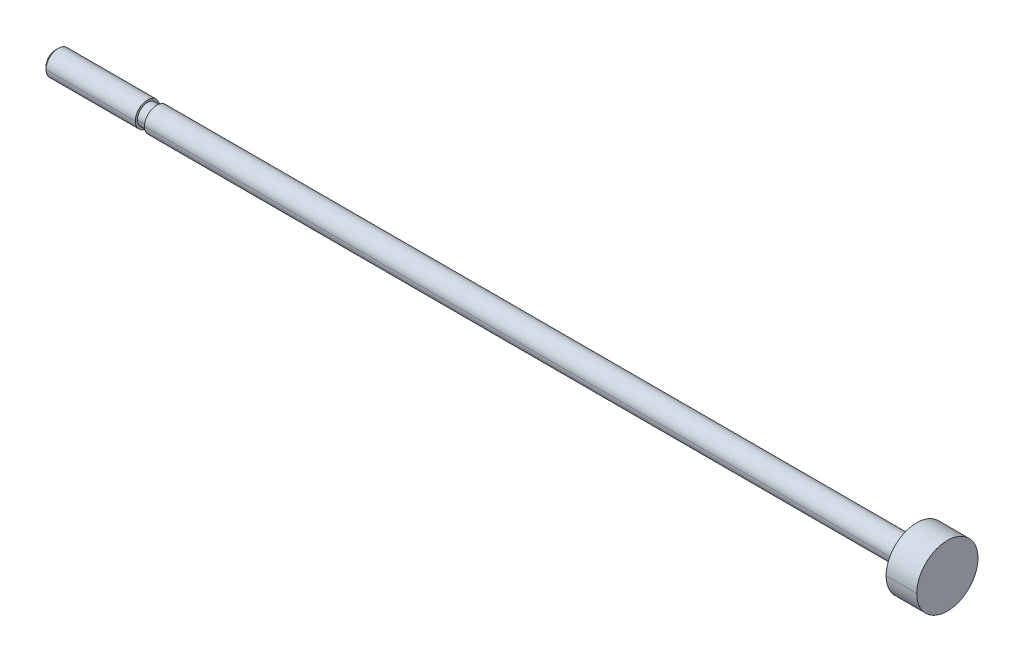
ISO-10303-21;
HEADER;
FILE_DESCRIPTION(('STEP AP214'),'2;1');
FILE_NAME('part.step','',(''),(''),'','','');
FILE_SCHEMA(('AUTOMOTIVE_DESIGN { 1 0 10303 214 1 1 1 1 }'));
ENDSEC;
DATA;
#1=APPLICATION_CONTEXT('core data for automotive mechanical design processes');
#2=APPLICATION_PROTOCOL_DEFINITION('international standard','automotive_design',2000,#1);
#3=PRODUCT_CONTEXT('',#1,'mechanical');
#4=PRODUCT('Part','Part','',(#3));
#5=PRODUCT_RELATED_PRODUCT_CATEGORY('part','',(#4));
#6=PRODUCT_DEFINITION_FORMATION('','',#4);
#7=PRODUCT_DEFINITION_CONTEXT('part definition',#1,'design');
#8=PRODUCT_DEFINITION('design','',#6,#7);
#9=PRODUCT_DEFINITION_SHAPE('','',#8);
#10=(LENGTH_UNIT() NAMED_UNIT(*) SI_UNIT(.MILLI.,.METRE.));
#11=(NAMED_UNIT(*) PLANE_ANGLE_UNIT() SI_UNIT($,.RADIAN.));
#12=(NAMED_UNIT(*) SI_UNIT($,.STERADIAN.) SOLID_ANGLE_UNIT());
#13=UNCERTAINTY_MEASURE_WITH_UNIT(LENGTH_MEASURE(1.E-05),#10,'distance_accuracy_value','');
#14=(GEOMETRIC_REPRESENTATION_CONTEXT(3) GLOBAL_UNCERTAINTY_ASSIGNED_CONTEXT((#13)) GLOBAL_UNIT_ASSIGNED_CONTEXT((#10,
#11,#12)) REPRESENTATION_CONTEXT('',''));
#15=CARTESIAN_POINT('',(0.,0.,0.));
#16=DIRECTION('',(0.,0.,1.));
#17=DIRECTION('',(1.,0.,0.));
#18=AXIS2_PLACEMENT_3D('',#15,#16,#17);
#19=CARTESIAN_POINT('',(145.5,0.,0.));
#20=DIRECTION('',(-1.,0.,0.));
#21=DIRECTION('',(0.,-1.,0.));
#22=AXIS2_PLACEMENT_3D('',#19,#20,#21);
#23=CYLINDRICAL_SURFACE('',#22,5.);
#24=CARTESIAN_POINT('',(145.5,0.,0.));
#25=DIRECTION('',(1.,0.,0.));
#26=DIRECTION('',(0.,0.,-1.));
#27=AXIS2_PLACEMENT_3D('',#24,#25,#26);
#28=CIRCLE('',#27,5.);
#29=CARTESIAN_POINT('',(145.5,0.,-5.));
#30=VERTEX_POINT('',#29);
#31=CARTESIAN_POINT('',(145.5,0.,5.));
#32=VERTEX_POINT('',#31);
#33=EDGE_CURVE('E11',#30,#32,#28,.T.);
#34=ORIENTED_EDGE('',*,*,#33,.F.);
#35=DIRECTION('',(-1.,0.,0.));
#36=VECTOR('',#35,1.);
#37=CARTESIAN_POINT('',(145.5,0.,-5.));
#38=LINE('',#37,#36);
#39=CARTESIAN_POINT('',(140.5,0.,-5.));
#40=VERTEX_POINT('',#39);
#41=EDGE_CURVE('E25',#30,#40,#38,.T.);
#42=ORIENTED_EDGE('',*,*,#41,.T.);
#43=CARTESIAN_POINT('',(140.5,0.,0.));
#44=DIRECTION('',(1.,0.,0.));
#45=DIRECTION('',(0.,0.,-1.));
#46=AXIS2_PLACEMENT_3D('',#43,#44,#45);
#47=CIRCLE('',#46,5.);
#48=CARTESIAN_POINT('',(140.5,0.,5.));
#49=VERTEX_POINT('',#48);
#50=EDGE_CURVE('E201',#40,#49,#47,.T.);
#51=ORIENTED_EDGE('',*,*,#50,.T.);
#52=DIRECTION('',(-1.,0.,0.));
#53=VECTOR('',#52,1.);
#54=CARTESIAN_POINT('',(145.5,0.,5.));
#55=LINE('',#54,#53);
#56=EDGE_CURVE('E196',#32,#49,#55,.T.);
#57=ORIENTED_EDGE('',*,*,#56,.F.);
#58=EDGE_LOOP('',(#34,#42,#51,#57));
#59=FACE_BOUND('',#58,.T.);
#60=ADVANCED_FACE('F17',(#59),#23,.T.);
#61=CARTESIAN_POINT('',(145.5,0.,0.));
#62=DIRECTION('',(-1.,0.,0.));
#63=DIRECTION('',(0.,1.,0.));
#64=AXIS2_PLACEMENT_3D('',#61,#62,#63);
#65=CYLINDRICAL_SURFACE('',#64,5.);
#66=CARTESIAN_POINT('',(140.5,0.,0.));
#67=DIRECTION('',(1.,0.,0.));
#68=DIRECTION('',(0.,0.,-1.));
#69=AXIS2_PLACEMENT_3D('',#66,#67,#68);
#70=CIRCLE('',#69,5.);
#71=EDGE_CURVE('E192',#49,#40,#70,.T.);
#72=ORIENTED_EDGE('',*,*,#71,.T.);
#73=ORIENTED_EDGE('',*,*,#41,.F.);
#74=CARTESIAN_POINT('',(145.5,0.,0.));
#75=DIRECTION('',(1.,0.,0.));
#76=DIRECTION('',(0.,0.,-1.));
#77=AXIS2_PLACEMENT_3D('',#74,#75,#76);
#78=CIRCLE('',#77,5.);
#79=EDGE_CURVE('E187',#32,#30,#78,.T.);
#80=ORIENTED_EDGE('',*,*,#79,.F.);
#81=ORIENTED_EDGE('',*,*,#56,.T.);
#82=EDGE_LOOP('',(#72,#73,#80,#81));
#83=FACE_BOUND('',#82,.T.);
#84=ADVANCED_FACE('F214',(#83),#65,.T.);
#85=CARTESIAN_POINT('',(145.5,5.,0.));
#86=DIRECTION('',(-1.,0.,0.));
#87=DIRECTION('',(0.,0.,1.));
#88=AXIS2_PLACEMENT_3D('',#85,#86,#87);
#89=PLANE('',#88);
#90=ORIENTED_EDGE('',*,*,#33,.T.);
#91=ORIENTED_EDGE('',*,*,#79,.T.);
#92=EDGE_LOOP('',(#90,#91));
#93=FACE_BOUND('',#92,.T.);
#94=ADVANCED_FACE('F219',(#93),#89,.F.);
#95=CARTESIAN_POINT('',(140.5,2.,0.));
#96=DIRECTION('',(1.,0.,0.));
#97=DIRECTION('',(0.,0.,-1.));
#98=AXIS2_PLACEMENT_3D('',#95,#96,#97);
#99=PLANE('',#98);
#100=ORIENTED_EDGE('',*,*,#50,.F.);
#101=ORIENTED_EDGE('',*,*,#71,.F.);
#102=EDGE_LOOP('',(#100,#101));
#103=FACE_BOUND('',#102,.T.);
#104=CARTESIAN_POINT('',(140.5,0.,0.));
#105=DIRECTION('',(1.,0.,0.));
#106=DIRECTION('',(0.,0.,-1.));
#107=AXIS2_PLACEMENT_3D('',#104,#105,#106);
#108=CIRCLE('',#107,2.);
#109=CARTESIAN_POINT('',(140.5,0.,-2.));
#110=VERTEX_POINT('',#109);
#111=CARTESIAN_POINT('',(140.5,0.,2.));
#112=VERTEX_POINT('',#111);
#113=EDGE_CURVE('E183',#110,#112,#108,.T.);
#114=ORIENTED_EDGE('',*,*,#113,.T.);
#115=CARTESIAN_POINT('',(140.5,0.,0.));
#116=DIRECTION('',(1.,0.,0.));
#117=DIRECTION('',(0.,0.,-1.));
#118=AXIS2_PLACEMENT_3D('',#115,#116,#117);
#119=CIRCLE('',#118,2.);
#120=EDGE_CURVE('E179',#112,#110,#119,.T.);
#121=ORIENTED_EDGE('',*,*,#120,.T.);
#122=EDGE_LOOP('',(#114,#121));
#123=FACE_BOUND('',#122,.T.);
#124=ADVANCED_FACE('F215',(#103,#123),#99,.F.);
#125=CARTESIAN_POINT('',(145.5,0.,0.));
#126=DIRECTION('',(-1.,0.,0.));
#127=DIRECTION('',(0.,1.,0.));
#128=AXIS2_PLACEMENT_3D('',#125,#126,#127);
#129=CYLINDRICAL_SURFACE('',#128,2.);
#130=CARTESIAN_POINT('',(16.5,0.,0.));
#131=DIRECTION('',(1.,0.,0.));
#132=DIRECTION('',(0.,0.,-1.));
#133=AXIS2_PLACEMENT_3D('',#130,#131,#132);
#134=CIRCLE('',#133,2.);
#135=CARTESIAN_POINT('',(16.5,0.,2.));
#136=VERTEX_POINT('',#135);
#137=CARTESIAN_POINT('',(16.5,0.,-2.));
#138=VERTEX_POINT('',#137);
#139=EDGE_CURVE('E175',#136,#138,#134,.T.);
#140=ORIENTED_EDGE('',*,*,#139,.T.);
#141=DIRECTION('',(-1.,0.,0.));
#142=VECTOR('',#141,1.);
#143=CARTESIAN_POINT('',(140.5,0.,-2.));
#144=LINE('',#143,#142);
#145=EDGE_CURVE('E170',#110,#138,#144,.T.);
#146=ORIENTED_EDGE('',*,*,#145,.F.);
#147=ORIENTED_EDGE('',*,*,#120,.F.);
#148=DIRECTION('',(-1.,0.,0.));
#149=VECTOR('',#148,1.);
#150=CARTESIAN_POINT('',(140.5,0.,2.));
#151=LINE('',#150,#149);
#152=EDGE_CURVE('E166',#112,#136,#151,.T.);
#153=ORIENTED_EDGE('',*,*,#152,.T.);
#154=EDGE_LOOP('',(#140,#146,#147,#153));
#155=FACE_BOUND('',#154,.T.);
#156=ADVANCED_FACE('F218',(#155),#129,.T.);
#157=CARTESIAN_POINT('',(145.5,0.,0.));
#158=DIRECTION('',(-1.,0.,0.));
#159=DIRECTION('',(0.,-1.,0.));
#160=AXIS2_PLACEMENT_3D('',#157,#158,#159);
#161=CYLINDRICAL_SURFACE('',#160,2.);
#162=ORIENTED_EDGE('',*,*,#113,.F.);
#163=ORIENTED_EDGE('',*,*,#145,.T.);
#164=CARTESIAN_POINT('',(16.5,0.,0.));
#165=DIRECTION('',(1.,0.,0.));
#166=DIRECTION('',(0.,0.,-1.));
#167=AXIS2_PLACEMENT_3D('',#164,#165,#166);
#168=CIRCLE('',#167,2.);
#169=EDGE_CURVE('E161',#138,#136,#168,.T.);
#170=ORIENTED_EDGE('',*,*,#169,.T.);
#171=ORIENTED_EDGE('',*,*,#152,.F.);
#172=EDGE_LOOP('',(#162,#163,#170,#171));
#173=FACE_BOUND('',#172,.T.);
#174=ADVANCED_FACE('F227',(#173),#161,.T.);
#175=CARTESIAN_POINT('',(16.5,1.65,0.));
#176=DIRECTION('',(1.,0.,0.));
#177=DIRECTION('',(0.,0.,-1.));
#178=AXIS2_PLACEMENT_3D('',#175,#176,#177);
#179=PLANE('',#178);
#180=ORIENTED_EDGE('',*,*,#169,.F.);
#181=ORIENTED_EDGE('',*,*,#139,.F.);
#182=EDGE_LOOP('',(#180,#181));
#183=FACE_BOUND('',#182,.T.);
#184=CARTESIAN_POINT('',(16.5,0.,0.));
#185=DIRECTION('',(1.,0.,0.));
#186=DIRECTION('',(0.,0.,-1.));
#187=AXIS2_PLACEMENT_3D('',#184,#185,#186);
#188=CIRCLE('',#187,1.65);
#189=CARTESIAN_POINT('',(16.5,0.,-1.65));
#190=VERTEX_POINT('',#189);
#191=CARTESIAN_POINT('',(16.5,0.,1.65));
#192=VERTEX_POINT('',#191);
#193=EDGE_CURVE('E157',#190,#192,#188,.T.);
#194=ORIENTED_EDGE('',*,*,#193,.T.);
#195=CARTESIAN_POINT('',(16.5,0.,0.));
#196=DIRECTION('',(1.,0.,0.));
#197=DIRECTION('',(0.,0.,-1.));
#198=AXIS2_PLACEMENT_3D('',#195,#196,#197);
#199=CIRCLE('',#198,1.65);
#200=EDGE_CURVE('E153',#192,#190,#199,.T.);
#201=ORIENTED_EDGE('',*,*,#200,.T.);
#202=EDGE_LOOP('',(#194,#201));
#203=FACE_BOUND('',#202,.T.);
#204=ADVANCED_FACE('F231',(#183,#203),#179,.F.);
#205=CARTESIAN_POINT('',(145.5,0.,0.));
#206=DIRECTION('',(-1.,0.,0.));
#207=DIRECTION('',(0.,1.,0.));
#208=AXIS2_PLACEMENT_3D('',#205,#206,#207);
#209=CYLINDRICAL_SURFACE('',#208,1.65);
#210=CARTESIAN_POINT('',(15.,0.,0.));
#211=DIRECTION('',(1.,0.,0.));
#212=DIRECTION('',(0.,0.,-1.));
#213=AXIS2_PLACEMENT_3D('',#210,#211,#212);
#214=CIRCLE('',#213,1.65);
#215=CARTESIAN_POINT('',(15.,0.,1.65));
#216=VERTEX_POINT('',#215);
#217=CARTESIAN_POINT('',(15.,0.,-1.65));
#218=VERTEX_POINT('',#217);
#219=EDGE_CURVE('E149',#216,#218,#214,.T.);
#220=ORIENTED_EDGE('',*,*,#219,.T.);
#221=DIRECTION('',(-1.,0.,0.));
#222=VECTOR('',#221,1.);
#223=CARTESIAN_POINT('',(16.5,0.,-1.65));
#224=LINE('',#223,#222);
#225=EDGE_CURVE('E144',#190,#218,#224,.T.);
#226=ORIENTED_EDGE('',*,*,#225,.F.);
#227=ORIENTED_EDGE('',*,*,#200,.F.);
#228=DIRECTION('',(-1.,0.,0.));
#229=VECTOR('',#228,1.);
#230=CARTESIAN_POINT('',(16.5,0.,1.65));
#231=LINE('',#230,#229);
#232=EDGE_CURVE('E140',#192,#216,#231,.T.);
#233=ORIENTED_EDGE('',*,*,#232,.T.);
#234=EDGE_LOOP('',(#220,#226,#227,#233));
#235=FACE_BOUND('',#234,.T.);
#236=ADVANCED_FACE('F234',(#235),#209,.T.);
#237=CARTESIAN_POINT('',(145.5,0.,0.));
#238=DIRECTION('',(-1.,0.,0.));
#239=DIRECTION('',(0.,-1.,0.));
#240=AXIS2_PLACEMENT_3D('',#237,#238,#239);
#241=CYLINDRICAL_SURFACE('',#240,1.65);
#242=ORIENTED_EDGE('',*,*,#193,.F.);
#243=ORIENTED_EDGE('',*,*,#225,.T.);
#244=CARTESIAN_POINT('',(15.,0.,0.));
#245=DIRECTION('',(1.,0.,0.));
#246=DIRECTION('',(0.,0.,-1.));
#247=AXIS2_PLACEMENT_3D('',#244,#245,#246);
#248=CIRCLE('',#247,1.65);
#249=EDGE_CURVE('E135',#218,#216,#248,.T.);
#250=ORIENTED_EDGE('',*,*,#249,.T.);
#251=ORIENTED_EDGE('',*,*,#232,.F.);
#252=EDGE_LOOP('',(#242,#243,#250,#251));
#253=FACE_BOUND('',#252,.T.);
#254=ADVANCED_FACE('F242',(#253),#241,.T.);
#255=CARTESIAN_POINT('',(15.,2.,0.));
#256=DIRECTION('',(-1.,0.,0.));
#257=DIRECTION('',(0.,0.,1.));
#258=AXIS2_PLACEMENT_3D('',#255,#256,#257);
#259=PLANE('',#258);
#260=ORIENTED_EDGE('',*,*,#249,.F.);
#261=ORIENTED_EDGE('',*,*,#219,.F.);
#262=EDGE_LOOP('',(#260,#261));
#263=FACE_BOUND('',#262,.T.);
#264=CARTESIAN_POINT('',(15.,0.,0.));
#265=DIRECTION('',(1.,0.,0.));
#266=DIRECTION('',(0.,0.,-1.));
#267=AXIS2_PLACEMENT_3D('',#264,#265,#266);
#268=CIRCLE('',#267,2.);
#269=CARTESIAN_POINT('',(15.,0.,-2.));
#270=VERTEX_POINT('',#269);
#271=CARTESIAN_POINT('',(15.,0.,2.));
#272=VERTEX_POINT('',#271);
#273=EDGE_CURVE('E131',#270,#272,#268,.T.);
#274=ORIENTED_EDGE('',*,*,#273,.T.);
#275=CARTESIAN_POINT('',(15.,0.,0.));
#276=DIRECTION('',(1.,0.,0.));
#277=DIRECTION('',(0.,0.,-1.));
#278=AXIS2_PLACEMENT_3D('',#275,#276,#277);
#279=CIRCLE('',#278,2.);
#280=EDGE_CURVE('E127',#272,#270,#279,.T.);
#281=ORIENTED_EDGE('',*,*,#280,.T.);
#282=EDGE_LOOP('',(#274,#281));
#283=FACE_BOUND('',#282,.T.);
#284=ADVANCED_FACE('F246',(#263,#283),#259,.F.);
#285=CARTESIAN_POINT('',(145.5,0.,0.));
#286=DIRECTION('',(-1.,0.,0.));
#287=DIRECTION('',(0.,1.,0.));
#288=AXIS2_PLACEMENT_3D('',#285,#286,#287);
#289=CYLINDRICAL_SURFACE('',#288,2.);
#290=CARTESIAN_POINT('',(0.429499999999999,0.,0.));
#291=DIRECTION('',(1.,0.,0.));
#292=DIRECTION('',(0.,0.,-1.));
#293=AXIS2_PLACEMENT_3D('',#290,#291,#292);
#294=CIRCLE('',#293,2.);
#295=CARTESIAN_POINT('',(0.42949999999999,0.,2.));
#296=VERTEX_POINT('',#295);
#297=CARTESIAN_POINT('',(0.429499999999999,0.,-2.));
#298=VERTEX_POINT('',#297);
#299=EDGE_CURVE('E98',#296,#298,#294,.T.);
#300=ORIENTED_EDGE('',*,*,#299,.T.);
#301=DIRECTION('',(-1.,0.,0.));
#302=VECTOR('',#301,1.);
#303=CARTESIAN_POINT('',(15.,0.,-2.));
#304=LINE('',#303,#302);
#305=EDGE_CURVE('E119',#270,#298,#304,.T.);
#306=ORIENTED_EDGE('',*,*,#305,.F.);
#307=ORIENTED_EDGE('',*,*,#280,.F.);
#308=DIRECTION('',(-1.,0.,0.));
#309=VECTOR('',#308,1.);
#310=CARTESIAN_POINT('',(15.,0.,2.));
#311=LINE('',#310,#309);
#312=EDGE_CURVE('E115',#272,#296,#311,.T.);
#313=ORIENTED_EDGE('',*,*,#312,.T.);
#314=EDGE_LOOP('',(#300,#306,#307,#313));
#315=FACE_BOUND('',#314,.T.);
#316=ADVANCED_FACE('F249',(#315),#289,.T.);
#317=CARTESIAN_POINT('',(145.5,0.,0.));
#318=DIRECTION('',(-1.,0.,0.));
#319=DIRECTION('',(0.,-1.,0.));
#320=AXIS2_PLACEMENT_3D('',#317,#318,#319);
#321=CYLINDRICAL_SURFACE('',#320,2.);
#322=ORIENTED_EDGE('',*,*,#273,.F.);
#323=ORIENTED_EDGE('',*,*,#305,.T.);
#324=CARTESIAN_POINT('',(0.429499999999999,0.,0.));
#325=DIRECTION('',(1.,0.,0.));
#326=DIRECTION('',(0.,0.,-1.));
#327=AXIS2_PLACEMENT_3D('',#324,#325,#326);
#328=CIRCLE('',#327,2.);
#329=EDGE_CURVE('E110',#298,#296,#328,.T.);
#330=ORIENTED_EDGE('',*,*,#329,.T.);
#331=ORIENTED_EDGE('',*,*,#312,.F.);
#332=EDGE_LOOP('',(#322,#323,#330,#331));
#333=FACE_BOUND('',#332,.T.);
#334=ADVANCED_FACE('F257',(#333),#321,.T.);
#335=CARTESIAN_POINT('',(0.,0.,0.));
#336=DIRECTION('',(1.,0.,0.));
#337=DIRECTION('',(0.,-1.,0.));
#338=AXIS2_PLACEMENT_3D('',#335,#336,#337);
#339=CONICAL_SURFACE('',#338,1.5705,0.7853981634);
#340=ORIENTED_EDGE('',*,*,#329,.F.);
#341=DIRECTION('',(0.707106781184743,0.,-0.707106781188352));
#342=VECTOR('',#341,1.);
#343=CARTESIAN_POINT('',(0.,0.,-1.5705));
#344=LINE('',#343,#342);
#345=CARTESIAN_POINT('',(0.,0.,-1.5705));
#346=VERTEX_POINT('',#345);
#347=EDGE_CURVE('E90',#346,#298,#344,.T.);
#348=ORIENTED_EDGE('',*,*,#347,.F.);
#349=CARTESIAN_POINT('',(0.,0.,0.));
#350=DIRECTION('',(1.,0.,0.));
#351=DIRECTION('',(0.,0.,-1.));
#352=AXIS2_PLACEMENT_3D('',#349,#350,#351);
#353=CIRCLE('',#352,1.5705);
#354=CARTESIAN_POINT('',(0.,0.,1.5705));
#355=VERTEX_POINT('',#354);
#356=EDGE_CURVE('E83',#346,#355,#353,.T.);
#357=ORIENTED_EDGE('',*,*,#356,.T.);
#358=DIRECTION('',(0.707106781184743,0.,0.707106781188352));
#359=VECTOR('',#358,1.);
#360=CARTESIAN_POINT('',(0.,0.,1.5705));
#361=LINE('',#360,#359);
#362=EDGE_CURVE('E87',#355,#296,#361,.T.);
#363=ORIENTED_EDGE('',*,*,#362,.T.);
#364=EDGE_LOOP('',(#340,#348,#357,#363));
#365=FACE_BOUND('',#364,.T.);
#366=ADVANCED_FACE('F86',(#365),#339,.T.);
#367=CARTESIAN_POINT('',(0.,0.,0.));
#368=DIRECTION('',(1.,0.,0.));
#369=DIRECTION('',(0.,1.,0.));
#370=AXIS2_PLACEMENT_3D('',#367,#368,#369);
#371=CONICAL_SURFACE('',#370,1.5705,0.7853981634);
#372=CARTESIAN_POINT('',(0.,0.,0.));
#373=DIRECTION('',(1.,0.,0.));
#374=DIRECTION('',(0.,0.,-1.));
#375=AXIS2_PLACEMENT_3D('',#372,#373,#374);
#376=CIRCLE('',#375,1.5705);
#377=EDGE_CURVE('E97',#355,#346,#376,.T.);
#378=ORIENTED_EDGE('',*,*,#377,.T.);
#379=ORIENTED_EDGE('',*,*,#347,.T.);
#380=ORIENTED_EDGE('',*,*,#299,.F.);
#381=ORIENTED_EDGE('',*,*,#362,.F.);
#382=EDGE_LOOP('',(#378,#379,#380,#381));
#383=FACE_BOUND('',#382,.T.);
#384=ADVANCED_FACE('F96',(#383),#371,.T.);
#385=CARTESIAN_POINT('',(0.,0.,0.));
#386=DIRECTION('',(1.,0.,0.));
#387=DIRECTION('',(0.,0.,-1.));
#388=AXIS2_PLACEMENT_3D('',#385,#386,#387);
#389=PLANE('',#388);
#390=ORIENTED_EDGE('',*,*,#356,.F.);
#391=ORIENTED_EDGE('',*,*,#377,.F.);
#392=EDGE_LOOP('',(#390,#391));
#393=FACE_BOUND('',#392,.T.);
#394=ADVANCED_FACE('F100',(#393),#389,.F.);
#395=CLOSED_SHELL('',(#60,#84,#94,#124,#156,#174,#204,#236,#254,#284,#316,#334,#366,#384,#394));
#396=MANIFOLD_SOLID_BREP('B1',#395);
#397=ADVANCED_BREP_SHAPE_REPRESENTATION('',(#18,#396),#14);
#398=SHAPE_DEFINITION_REPRESENTATION(#9,#397);
ENDSEC;
END-ISO-10303-21;
